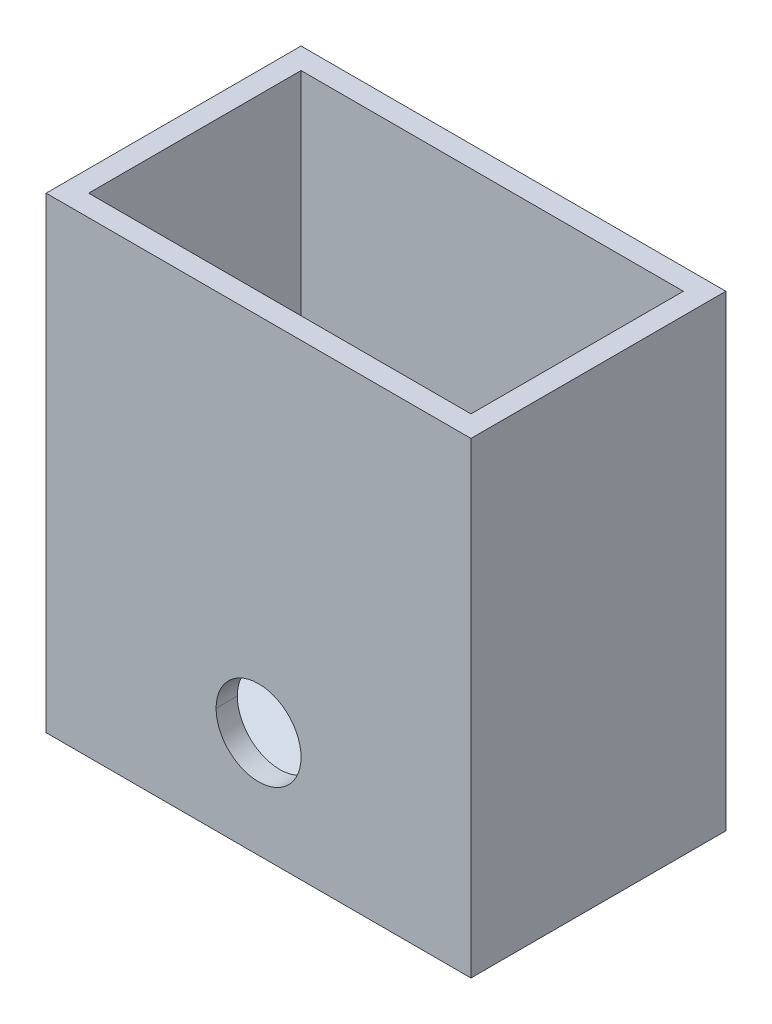
ISO-10303-21;
HEADER;
FILE_DESCRIPTION(('STEP AP214'),'2;1');
FILE_NAME('part.step','',(''),(''),'','','');
FILE_SCHEMA(('AUTOMOTIVE_DESIGN { 1 0 10303 214 1 1 1 1 }'));
ENDSEC;
DATA;
#1=APPLICATION_CONTEXT('core data for automotive mechanical design processes');
#2=APPLICATION_PROTOCOL_DEFINITION('international standard','automotive_design',2000,#1);
#3=PRODUCT_CONTEXT('',#1,'mechanical');
#4=PRODUCT('Part','Part','',(#3));
#5=PRODUCT_RELATED_PRODUCT_CATEGORY('part','',(#4));
#6=PRODUCT_DEFINITION_FORMATION('','',#4);
#7=PRODUCT_DEFINITION_CONTEXT('part definition',#1,'design');
#8=PRODUCT_DEFINITION('design','',#6,#7);
#9=PRODUCT_DEFINITION_SHAPE('','',#8);
#10=(LENGTH_UNIT() NAMED_UNIT(*) SI_UNIT(.MILLI.,.METRE.));
#11=(NAMED_UNIT(*) PLANE_ANGLE_UNIT() SI_UNIT($,.RADIAN.));
#12=(NAMED_UNIT(*) SI_UNIT($,.STERADIAN.) SOLID_ANGLE_UNIT());
#13=UNCERTAINTY_MEASURE_WITH_UNIT(LENGTH_MEASURE(1.E-05),#10,'distance_accuracy_value','');
#14=(GEOMETRIC_REPRESENTATION_CONTEXT(3) GLOBAL_UNCERTAINTY_ASSIGNED_CONTEXT((#13)) GLOBAL_UNIT_ASSIGNED_CONTEXT((#10,
#11,#12)) REPRESENTATION_CONTEXT('',''));
#15=CARTESIAN_POINT('',(0.,0.,0.));
#16=DIRECTION('',(0.,0.,1.));
#17=DIRECTION('',(1.,0.,0.));
#18=AXIS2_PLACEMENT_3D('',#15,#16,#17);
#19=CARTESIAN_POINT('',(100.,120.046296296296,110.));
#20=DIRECTION('',(0.,0.,1.));
#21=DIRECTION('',(1.,0.,0.));
#22=AXIS2_PLACEMENT_3D('',#19,#20,#21);
#23=CYLINDRICAL_SURFACE('',#22,20.);
#24=DIRECTION('',(0.,0.,1.));
#25=VECTOR('',#24,1.);
#26=CARTESIAN_POINT('',(80.,120.046296296296,110.));
#27=LINE('',#26,#25);
#28=CARTESIAN_POINT('',(80.,120.046296296296,110.));
#29=VERTEX_POINT('',#28);
#30=CARTESIAN_POINT('',(80.,120.046296296296,120.));
#31=VERTEX_POINT('',#30);
#32=EDGE_CURVE('E20',#29,#31,#27,.T.);
#33=ORIENTED_EDGE('',*,*,#32,.F.);
#34=CARTESIAN_POINT('',(100.,120.046296296296,110.));
#35=DIRECTION('',(0.,0.,1.));
#36=DIRECTION('',(1.,0.,0.));
#37=AXIS2_PLACEMENT_3D('',#34,#35,#36);
#38=CIRCLE('',#37,20.);
#39=CARTESIAN_POINT('',(120.,120.046296296296,110.));
#40=VERTEX_POINT('',#39);
#41=EDGE_CURVE('E11',#40,#29,#38,.T.);
#42=ORIENTED_EDGE('',*,*,#41,.F.);
#43=DIRECTION('',(0.,0.,1.));
#44=VECTOR('',#43,1.);
#45=CARTESIAN_POINT('',(120.,120.046296296296,110.));
#46=LINE('',#45,#44);
#47=CARTESIAN_POINT('',(120.,120.046296296296,120.));
#48=VERTEX_POINT('',#47);
#49=EDGE_CURVE('E181',#40,#48,#46,.T.);
#50=ORIENTED_EDGE('',*,*,#49,.T.);
#51=CARTESIAN_POINT('',(100.,120.046296296296,120.));
#52=DIRECTION('',(0.,0.,1.));
#53=DIRECTION('',(1.,0.,0.));
#54=AXIS2_PLACEMENT_3D('',#51,#52,#53);
#55=CIRCLE('',#54,20.);
#56=EDGE_CURVE('E228',#48,#31,#55,.T.);
#57=ORIENTED_EDGE('',*,*,#56,.T.);
#58=EDGE_LOOP('',(#33,#42,#50,#57));
#59=FACE_BOUND('',#58,.T.);
#60=ADVANCED_FACE('F16',(#59),#23,.F.);
#61=CARTESIAN_POINT('',(190.,106.464052017137,69.575962429987));
#62=DIRECTION('',(0.,0.837096174229633,0.547055751354569));
#63=DIRECTION('',(1.,0.,0.));
#64=AXIS2_PLACEMENT_3D('',#61,#62,#63);
#65=PLANE('',#64);
#66=DIRECTION('',(0.,0.547055751354569,-0.837096174229633));
#67=VECTOR('',#66,1.);
#68=CARTESIAN_POINT('',(10.,106.464052017137,69.5759624299871));
#69=LINE('',#68,#67);
#70=CARTESIAN_POINT('',(10.,80.0462962962963,110.));
#71=VERTEX_POINT('',#70);
#72=CARTESIAN_POINT('',(10.,145.39789724681,10.));
#73=VERTEX_POINT('',#72);
#74=EDGE_CURVE('E202',#71,#73,#69,.T.);
#75=ORIENTED_EDGE('',*,*,#74,.F.);
#76=DIRECTION('',(1.,0.,0.));
#77=VECTOR('',#76,1.);
#78=CARTESIAN_POINT('',(10.,80.0462962962963,110.));
#79=LINE('',#78,#77);
#80=CARTESIAN_POINT('',(190.,80.0462962962963,110.));
#81=VERTEX_POINT('',#80);
#82=EDGE_CURVE('E26',#71,#81,#79,.T.);
#83=ORIENTED_EDGE('',*,*,#82,.T.);
#84=DIRECTION('',(0.,0.547055751354569,-0.837096174229633));
#85=VECTOR('',#84,1.);
#86=CARTESIAN_POINT('',(190.,106.464052017137,69.575962429987));
#87=LINE('',#86,#85);
#88=CARTESIAN_POINT('',(190.,145.39789724681,10.));
#89=VERTEX_POINT('',#88);
#90=EDGE_CURVE('E50',#81,#89,#87,.T.);
#91=ORIENTED_EDGE('',*,*,#90,.T.);
#92=DIRECTION('',(-1.,0.,0.));
#93=VECTOR('',#92,1.);
#94=CARTESIAN_POINT('',(190.,145.39789724681,10.));
#95=LINE('',#94,#93);
#96=EDGE_CURVE('E246',#89,#73,#95,.T.);
#97=ORIENTED_EDGE('',*,*,#96,.T.);
#98=EDGE_LOOP('',(#75,#83,#91,#97));
#99=FACE_BOUND('',#98,.T.);
#100=ADVANCED_FACE('F345',(#99),#65,.T.);
#101=CARTESIAN_POINT('',(10.,80.0462962962963,110.));
#102=DIRECTION('',(0.,0.,1.));
#103=DIRECTION('',(1.,0.,0.));
#104=AXIS2_PLACEMENT_3D('',#101,#102,#103);
#105=PLANE('',#104);
#106=ORIENTED_EDGE('',*,*,#41,.T.);
#107=CARTESIAN_POINT('',(100.,120.046296296296,110.));
#108=DIRECTION('',(0.,0.,1.));
#109=DIRECTION('',(1.,0.,0.));
#110=AXIS2_PLACEMENT_3D('',#107,#108,#109);
#111=CIRCLE('',#110,20.);
#112=EDGE_CURVE('E253',#29,#40,#111,.T.);
#113=ORIENTED_EDGE('',*,*,#112,.T.);
#114=EDGE_LOOP('',(#106,#113));
#115=FACE_BOUND('',#114,.T.);
#116=DIRECTION('',(1.,0.,0.));
#117=VECTOR('',#116,1.);
#118=CARTESIAN_POINT('',(10.,290.046296296296,110.));
#119=LINE('',#118,#117);
#120=CARTESIAN_POINT('',(10.,290.046296296296,110.));
#121=VERTEX_POINT('',#120);
#122=CARTESIAN_POINT('',(190.,290.046296296296,110.));
#123=VERTEX_POINT('',#122);
#124=EDGE_CURVE('E188',#121,#123,#119,.T.);
#125=ORIENTED_EDGE('',*,*,#124,.T.);
#126=DIRECTION('',(0.,1.,0.));
#127=VECTOR('',#126,1.);
#128=CARTESIAN_POINT('',(190.,80.0462962962963,110.));
#129=LINE('',#128,#127);
#130=EDGE_CURVE('E201',#81,#123,#129,.T.);
#131=ORIENTED_EDGE('',*,*,#130,.F.);
#132=ORIENTED_EDGE('',*,*,#82,.F.);
#133=DIRECTION('',(0.,1.,0.));
#134=VECTOR('',#133,1.);
#135=CARTESIAN_POINT('',(10.,80.0462962962963,110.));
#136=LINE('',#135,#134);
#137=EDGE_CURVE('E173',#71,#121,#136,.T.);
#138=ORIENTED_EDGE('',*,*,#137,.T.);
#139=EDGE_LOOP('',(#125,#131,#132,#138));
#140=FACE_BOUND('',#139,.T.);
#141=ADVANCED_FACE('F349',(#115,#140),#105,.F.);
#142=CARTESIAN_POINT('',(190.,80.0462962962963,10.));
#143=DIRECTION('',(1.,0.,0.));
#144=DIRECTION('',(0.,1.,0.));
#145=AXIS2_PLACEMENT_3D('',#142,#143,#144);
#146=PLANE('',#145);
#147=DIRECTION('',(0.,1.,0.));
#148=VECTOR('',#147,1.);
#149=CARTESIAN_POINT('',(190.,80.0462962962963,10.));
#150=LINE('',#149,#148);
#151=CARTESIAN_POINT('',(190.,290.046296296296,10.));
#152=VERTEX_POINT('',#151);
#153=EDGE_CURVE('E81',#89,#152,#150,.T.);
#154=ORIENTED_EDGE('',*,*,#153,.F.);
#155=ORIENTED_EDGE('',*,*,#90,.F.);
#156=ORIENTED_EDGE('',*,*,#130,.T.);
#157=DIRECTION('',(0.,0.,-1.));
#158=VECTOR('',#157,1.);
#159=CARTESIAN_POINT('',(190.,290.046296296296,10.));
#160=LINE('',#159,#158);
#161=EDGE_CURVE('E223',#123,#152,#160,.T.);
#162=ORIENTED_EDGE('',*,*,#161,.T.);
#163=EDGE_LOOP('',(#154,#155,#156,#162));
#164=FACE_BOUND('',#163,.T.);
#165=ADVANCED_FACE('F400',(#164),#146,.F.);
#166=CARTESIAN_POINT('',(10.,80.0462962962963,10.));
#167=DIRECTION('',(0.,0.,-1.));
#168=DIRECTION('',(0.,-1.,0.));
#169=AXIS2_PLACEMENT_3D('',#166,#167,#168);
#170=PLANE('',#169);
#171=DIRECTION('',(0.,1.,0.));
#172=VECTOR('',#171,1.);
#173=CARTESIAN_POINT('',(10.,80.0462962962963,10.));
#174=LINE('',#173,#172);
#175=CARTESIAN_POINT('',(10.,290.046296296296,10.));
#176=VERTEX_POINT('',#175);
#177=EDGE_CURVE('E95',#73,#176,#174,.T.);
#178=ORIENTED_EDGE('',*,*,#177,.F.);
#179=ORIENTED_EDGE('',*,*,#96,.F.);
#180=ORIENTED_EDGE('',*,*,#153,.T.);
#181=DIRECTION('',(-1.,0.,0.));
#182=VECTOR('',#181,1.);
#183=CARTESIAN_POINT('',(10.,290.046296296296,10.));
#184=LINE('',#183,#182);
#185=EDGE_CURVE('E187',#152,#176,#184,.T.);
#186=ORIENTED_EDGE('',*,*,#185,.T.);
#187=EDGE_LOOP('',(#178,#179,#180,#186));
#188=FACE_BOUND('',#187,.T.);
#189=ADVANCED_FACE('F396',(#188),#170,.F.);
#190=CARTESIAN_POINT('',(10.,80.0462962962963,10.));
#191=DIRECTION('',(-1.,0.,0.));
#192=DIRECTION('',(0.,1.,0.));
#193=AXIS2_PLACEMENT_3D('',#190,#191,#192);
#194=PLANE('',#193);
#195=ORIENTED_EDGE('',*,*,#137,.F.);
#196=ORIENTED_EDGE('',*,*,#74,.T.);
#197=ORIENTED_EDGE('',*,*,#177,.T.);
#198=DIRECTION('',(0.,0.,1.));
#199=VECTOR('',#198,1.);
#200=CARTESIAN_POINT('',(10.,290.046296296296,10.));
#201=LINE('',#200,#199);
#202=EDGE_CURVE('E184',#176,#121,#201,.T.);
#203=ORIENTED_EDGE('',*,*,#202,.T.);
#204=EDGE_LOOP('',(#195,#196,#197,#203));
#205=FACE_BOUND('',#204,.T.);
#206=ADVANCED_FACE('F18',(#205),#194,.F.);
#207=CARTESIAN_POINT('',(0.,0.,0.));
#208=DIRECTION('',(0.,0.,1.));
#209=DIRECTION('',(1.,0.,0.));
#210=AXIS2_PLACEMENT_3D('',#207,#208,#209);
#211=PLANE('',#210);
#212=DIRECTION('',(0.,-1.,0.));
#213=VECTOR('',#212,1.);
#214=CARTESIAN_POINT('',(0.,290.046296296296,0.));
#215=LINE('',#214,#213);
#216=CARTESIAN_POINT('',(0.,290.046296296296,0.));
#217=VERTEX_POINT('',#216);
#218=CARTESIAN_POINT('',(0.,70.0462962962963,0.));
#219=VERTEX_POINT('',#218);
#220=EDGE_CURVE('E176',#217,#219,#215,.T.);
#221=ORIENTED_EDGE('',*,*,#220,.F.);
#222=DIRECTION('',(-1.,0.,0.));
#223=VECTOR('',#222,1.);
#224=CARTESIAN_POINT('',(0.,290.046296296296,0.));
#225=LINE('',#224,#223);
#226=CARTESIAN_POINT('',(200.,290.046296296296,0.));
#227=VERTEX_POINT('',#226);
#228=EDGE_CURVE('E147',#227,#217,#225,.T.);
#229=ORIENTED_EDGE('',*,*,#228,.F.);
#230=DIRECTION('',(0.,1.,0.));
#231=VECTOR('',#230,1.);
#232=CARTESIAN_POINT('',(200.,290.046296296296,0.));
#233=LINE('',#232,#231);
#234=CARTESIAN_POINT('',(200.,70.0462962962963,0.));
#235=VERTEX_POINT('',#234);
#236=EDGE_CURVE('E158',#235,#227,#233,.T.);
#237=ORIENTED_EDGE('',*,*,#236,.F.);
#238=DIRECTION('',(1.,0.,0.));
#239=VECTOR('',#238,1.);
#240=CARTESIAN_POINT('',(0.,70.0462962962963,0.));
#241=LINE('',#240,#239);
#242=EDGE_CURVE('E161',#219,#235,#241,.T.);
#243=ORIENTED_EDGE('',*,*,#242,.F.);
#244=EDGE_LOOP('',(#221,#229,#237,#243));
#245=FACE_BOUND('',#244,.T.);
#246=ADVANCED_FACE('F365',(#245),#211,.F.);
#247=CARTESIAN_POINT('',(0.,0.,120.));
#248=DIRECTION('',(0.,0.,1.));
#249=DIRECTION('',(1.,0.,0.));
#250=AXIS2_PLACEMENT_3D('',#247,#248,#249);
#251=PLANE('',#250);
#252=ORIENTED_EDGE('',*,*,#56,.F.);
#253=CARTESIAN_POINT('',(100.,120.046296296296,120.));
#254=DIRECTION('',(0.,0.,1.));
#255=DIRECTION('',(1.,0.,0.));
#256=AXIS2_PLACEMENT_3D('',#253,#254,#255);
#257=CIRCLE('',#256,20.);
#258=EDGE_CURVE('E191',#31,#48,#257,.T.);
#259=ORIENTED_EDGE('',*,*,#258,.F.);
#260=EDGE_LOOP('',(#252,#259));
#261=FACE_BOUND('',#260,.T.);
#262=DIRECTION('',(0.,-1.,0.));
#263=VECTOR('',#262,1.);
#264=CARTESIAN_POINT('',(0.,290.046296296296,120.));
#265=LINE('',#264,#263);
#266=CARTESIAN_POINT('',(0.,290.046296296296,120.));
#267=VERTEX_POINT('',#266);
#268=CARTESIAN_POINT('',(0.,70.0462962962963,120.));
#269=VERTEX_POINT('',#268);
#270=EDGE_CURVE('E153',#267,#269,#265,.T.);
#271=ORIENTED_EDGE('',*,*,#270,.T.);
#272=DIRECTION('',(1.,0.,0.));
#273=VECTOR('',#272,1.);
#274=CARTESIAN_POINT('',(0.,70.0462962962963,120.));
#275=LINE('',#274,#273);
#276=CARTESIAN_POINT('',(200.,70.0462962962963,120.));
#277=VERTEX_POINT('',#276);
#278=EDGE_CURVE('E150',#269,#277,#275,.T.);
#279=ORIENTED_EDGE('',*,*,#278,.T.);
#280=DIRECTION('',(0.,1.,0.));
#281=VECTOR('',#280,1.);
#282=CARTESIAN_POINT('',(200.,290.046296296296,120.));
#283=LINE('',#282,#281);
#284=CARTESIAN_POINT('',(200.,290.046296296296,120.));
#285=VERTEX_POINT('',#284);
#286=EDGE_CURVE('E136',#277,#285,#283,.T.);
#287=ORIENTED_EDGE('',*,*,#286,.T.);
#288=DIRECTION('',(-1.,0.,0.));
#289=VECTOR('',#288,1.);
#290=CARTESIAN_POINT('',(0.,290.046296296296,120.));
#291=LINE('',#290,#289);
#292=EDGE_CURVE('E197',#285,#267,#291,.T.);
#293=ORIENTED_EDGE('',*,*,#292,.T.);
#294=EDGE_LOOP('',(#271,#279,#287,#293));
#295=FACE_BOUND('',#294,.T.);
#296=ADVANCED_FACE('F151',(#261,#295),#251,.T.);
#297=CARTESIAN_POINT('',(0.,290.046296296296,120.));
#298=DIRECTION('',(0.,-1.,0.));
#299=DIRECTION('',(0.,0.,-1.));
#300=AXIS2_PLACEMENT_3D('',#297,#298,#299);
#301=PLANE('',#300);
#302=ORIENTED_EDGE('',*,*,#124,.F.);
#303=ORIENTED_EDGE('',*,*,#202,.F.);
#304=ORIENTED_EDGE('',*,*,#185,.F.);
#305=ORIENTED_EDGE('',*,*,#161,.F.);
#306=EDGE_LOOP('',(#302,#303,#304,#305));
#307=FACE_BOUND('',#306,.T.);
#308=ORIENTED_EDGE('',*,*,#228,.T.);
#309=DIRECTION('',(0.,0.,-1.));
#310=VECTOR('',#309,1.);
#311=CARTESIAN_POINT('',(0.,290.046296296296,120.));
#312=LINE('',#311,#310);
#313=EDGE_CURVE('E169',#267,#217,#312,.T.);
#314=ORIENTED_EDGE('',*,*,#313,.F.);
#315=ORIENTED_EDGE('',*,*,#292,.F.);
#316=DIRECTION('',(0.,0.,-1.));
#317=VECTOR('',#316,1.);
#318=CARTESIAN_POINT('',(200.,290.046296296296,120.));
#319=LINE('',#318,#317);
#320=EDGE_CURVE('E144',#285,#227,#319,.T.);
#321=ORIENTED_EDGE('',*,*,#320,.T.);
#322=EDGE_LOOP('',(#308,#314,#315,#321));
#323=FACE_BOUND('',#322,.T.);
#324=ADVANCED_FACE('F357',(#307,#323),#301,.F.);
#325=CARTESIAN_POINT('',(200.,290.046296296296,120.));
#326=DIRECTION('',(-1.,0.,0.));
#327=DIRECTION('',(0.,1.,0.));
#328=AXIS2_PLACEMENT_3D('',#325,#326,#327);
#329=PLANE('',#328);
#330=ORIENTED_EDGE('',*,*,#236,.T.);
#331=ORIENTED_EDGE('',*,*,#320,.F.);
#332=ORIENTED_EDGE('',*,*,#286,.F.);
#333=DIRECTION('',(0.,0.,-1.));
#334=VECTOR('',#333,1.);
#335=CARTESIAN_POINT('',(200.,70.0462962962963,120.));
#336=LINE('',#335,#334);
#337=EDGE_CURVE('E141',#277,#235,#336,.T.);
#338=ORIENTED_EDGE('',*,*,#337,.T.);
#339=EDGE_LOOP('',(#330,#331,#332,#338));
#340=FACE_BOUND('',#339,.T.);
#341=ADVANCED_FACE('F139',(#340),#329,.F.);
#342=CARTESIAN_POINT('',(0.,70.0462962962963,120.));
#343=DIRECTION('',(0.,1.,0.));
#344=DIRECTION('',(1.,0.,0.));
#345=AXIS2_PLACEMENT_3D('',#342,#343,#344);
#346=PLANE('',#345);
#347=ORIENTED_EDGE('',*,*,#242,.T.);
#348=ORIENTED_EDGE('',*,*,#337,.F.);
#349=ORIENTED_EDGE('',*,*,#278,.F.);
#350=DIRECTION('',(0.,0.,-1.));
#351=VECTOR('',#350,1.);
#352=CARTESIAN_POINT('',(0.,70.0462962962963,120.));
#353=LINE('',#352,#351);
#354=EDGE_CURVE('E180',#269,#219,#353,.T.);
#355=ORIENTED_EDGE('',*,*,#354,.T.);
#356=EDGE_LOOP('',(#347,#348,#349,#355));
#357=FACE_BOUND('',#356,.T.);
#358=ADVANCED_FACE('F160',(#357),#346,.F.);
#359=CARTESIAN_POINT('',(0.,290.046296296296,120.));
#360=DIRECTION('',(1.,0.,0.));
#361=DIRECTION('',(0.,1.,0.));
#362=AXIS2_PLACEMENT_3D('',#359,#360,#361);
#363=PLANE('',#362);
#364=ORIENTED_EDGE('',*,*,#220,.T.);
#365=ORIENTED_EDGE('',*,*,#354,.F.);
#366=ORIENTED_EDGE('',*,*,#270,.F.);
#367=ORIENTED_EDGE('',*,*,#313,.T.);
#368=EDGE_LOOP('',(#364,#365,#366,#367));
#369=FACE_BOUND('',#368,.T.);
#370=ADVANCED_FACE('F383',(#369),#363,.F.);
#371=CARTESIAN_POINT('',(100.,120.046296296296,110.));
#372=DIRECTION('',(0.,0.,1.));
#373=DIRECTION('',(1.,0.,0.));
#374=AXIS2_PLACEMENT_3D('',#371,#372,#373);
#375=CYLINDRICAL_SURFACE('',#374,20.);
#376=ORIENTED_EDGE('',*,*,#112,.F.);
#377=ORIENTED_EDGE('',*,*,#32,.T.);
#378=ORIENTED_EDGE('',*,*,#258,.T.);
#379=ORIENTED_EDGE('',*,*,#49,.F.);
#380=EDGE_LOOP('',(#376,#377,#378,#379));
#381=FACE_BOUND('',#380,.T.);
#382=ADVANCED_FACE('F379',(#381),#375,.F.);
#383=CLOSED_SHELL('',(#60,#100,#141,#165,#189,#206,#246,#296,#324,#341,#358,#370,#382));
#384=MANIFOLD_SOLID_BREP('B1',#383);
#385=ADVANCED_BREP_SHAPE_REPRESENTATION('',(#18,#384),#14);
#386=SHAPE_DEFINITION_REPRESENTATION(#9,#385);
ENDSEC;
END-ISO-10303-21;
